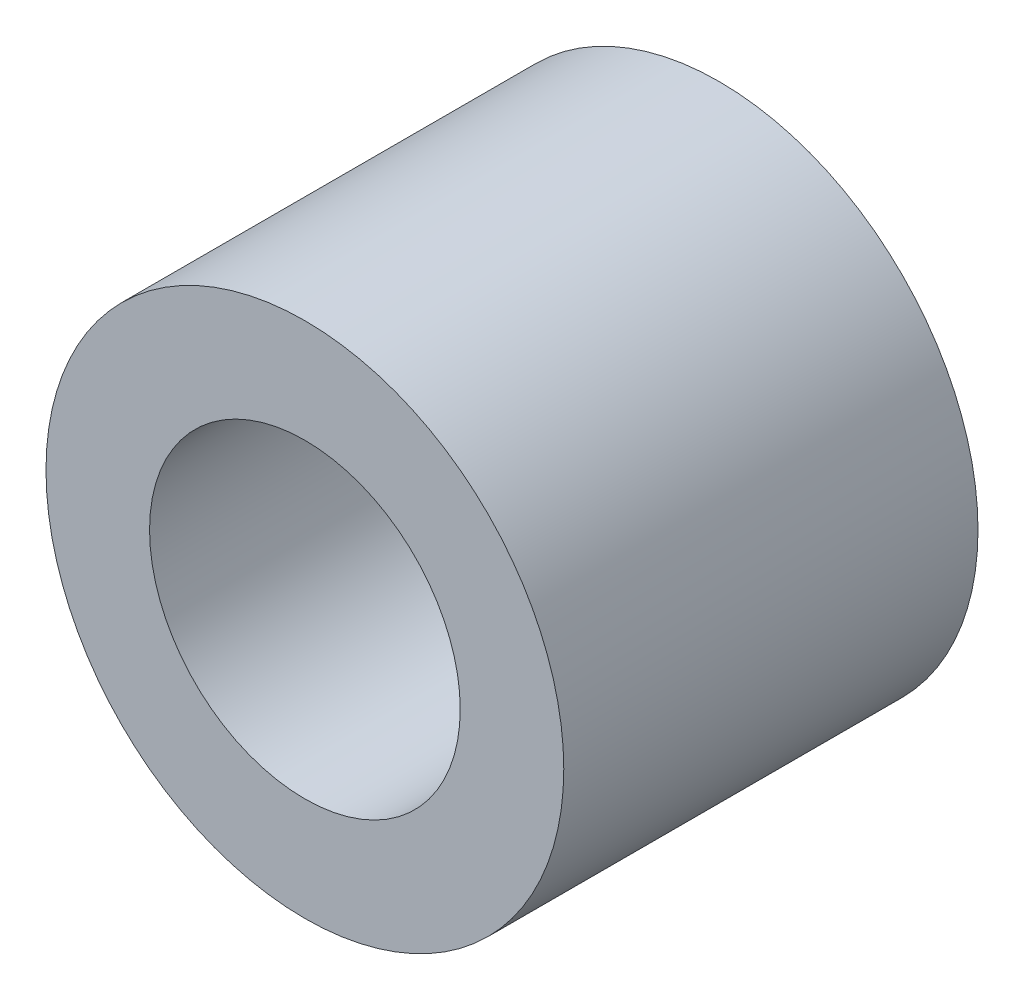
ISO-10303-21;
HEADER;
FILE_DESCRIPTION(('STEP AP214'),'2;1');
FILE_NAME('part.step','',(''),(''),'','','');
FILE_SCHEMA(('AUTOMOTIVE_DESIGN { 1 0 10303 214 1 1 1 1 }'));
ENDSEC;
DATA;
#1=APPLICATION_CONTEXT('core data for automotive mechanical design processes');
#2=APPLICATION_PROTOCOL_DEFINITION('international standard','automotive_design',2000,#1);
#3=PRODUCT_CONTEXT('',#1,'mechanical');
#4=PRODUCT('Part','Part','',(#3));
#5=PRODUCT_RELATED_PRODUCT_CATEGORY('part','',(#4));
#6=PRODUCT_DEFINITION_FORMATION('','',#4);
#7=PRODUCT_DEFINITION_CONTEXT('part definition',#1,'design');
#8=PRODUCT_DEFINITION('design','',#6,#7);
#9=PRODUCT_DEFINITION_SHAPE('','',#8);
#10=(LENGTH_UNIT() NAMED_UNIT(*) SI_UNIT(.MILLI.,.METRE.));
#11=(NAMED_UNIT(*) PLANE_ANGLE_UNIT() SI_UNIT($,.RADIAN.));
#12=(NAMED_UNIT(*) SI_UNIT($,.STERADIAN.) SOLID_ANGLE_UNIT());
#13=UNCERTAINTY_MEASURE_WITH_UNIT(LENGTH_MEASURE(1.E-05),#10,'distance_accuracy_value','');
#14=(GEOMETRIC_REPRESENTATION_CONTEXT(3) GLOBAL_UNCERTAINTY_ASSIGNED_CONTEXT((#13)) GLOBAL_UNIT_ASSIGNED_CONTEXT((#10,
#11,#12)) REPRESENTATION_CONTEXT('',''));
#15=CARTESIAN_POINT('',(0.,0.,0.));
#16=DIRECTION('',(0.,0.,1.));
#17=DIRECTION('',(1.,0.,0.));
#18=AXIS2_PLACEMENT_3D('',#15,#16,#17);
#19=CARTESIAN_POINT('',(0.,0.,3.175));
#20=DIRECTION('',(0.,0.,1.));
#21=DIRECTION('',(1.,0.,0.));
#22=AXIS2_PLACEMENT_3D('',#19,#20,#21);
#23=PLANE('',#22);
#24=CARTESIAN_POINT('',(0.,0.,3.175));
#25=DIRECTION('',(0.,0.,1.));
#26=DIRECTION('',(1.,0.,0.));
#27=AXIS2_PLACEMENT_3D('',#24,#25,#26);
#28=CIRCLE('',#27,3.96875);
#29=CARTESIAN_POINT('',(3.96875,0.,3.175));
#30=VERTEX_POINT('',#29);
#31=EDGE_CURVE('E10',#30,#30,#28,.T.);
#32=ORIENTED_EDGE('',*,*,#31,.T.);
#33=EDGE_LOOP('',(#32));
#34=FACE_BOUND('',#33,.T.);
#35=CARTESIAN_POINT('',(0.,0.,3.175));
#36=DIRECTION('',(0.,0.,1.));
#37=DIRECTION('',(1.,0.,0.));
#38=AXIS2_PLACEMENT_3D('',#35,#36,#37);
#39=CIRCLE('',#38,2.38125);
#40=CARTESIAN_POINT('',(2.38125,0.,3.175));
#41=VERTEX_POINT('',#40);
#42=EDGE_CURVE('E45',#41,#41,#39,.T.);
#43=ORIENTED_EDGE('',*,*,#42,.F.);
#44=EDGE_LOOP('',(#43));
#45=FACE_BOUND('',#44,.T.);
#46=ADVANCED_FACE('F34',(#34,#45),#23,.T.);
#47=CARTESIAN_POINT('',(0.,0.,-3.175));
#48=DIRECTION('',(0.,0.,1.));
#49=DIRECTION('',(1.,0.,0.));
#50=AXIS2_PLACEMENT_3D('',#47,#48,#49);
#51=PLANE('',#50);
#52=CARTESIAN_POINT('',(0.,0.,-3.175));
#53=DIRECTION('',(0.,0.,1.));
#54=DIRECTION('',(1.,0.,0.));
#55=AXIS2_PLACEMENT_3D('',#52,#53,#54);
#56=CIRCLE('',#55,3.96875);
#57=CARTESIAN_POINT('',(3.96875,0.,-3.175));
#58=VERTEX_POINT('',#57);
#59=EDGE_CURVE('E38',#58,#58,#56,.T.);
#60=ORIENTED_EDGE('',*,*,#59,.F.);
#61=EDGE_LOOP('',(#60));
#62=FACE_BOUND('',#61,.T.);
#63=CARTESIAN_POINT('',(0.,0.,-3.175));
#64=DIRECTION('',(0.,0.,1.));
#65=DIRECTION('',(1.,0.,0.));
#66=AXIS2_PLACEMENT_3D('',#63,#64,#65);
#67=CIRCLE('',#66,2.38125);
#68=CARTESIAN_POINT('',(2.38125,0.,-3.175));
#69=VERTEX_POINT('',#68);
#70=EDGE_CURVE('E47',#69,#69,#67,.T.);
#71=ORIENTED_EDGE('',*,*,#70,.T.);
#72=EDGE_LOOP('',(#71));
#73=FACE_BOUND('',#72,.T.);
#74=ADVANCED_FACE('F57',(#62,#73),#51,.F.);
#75=CARTESIAN_POINT('',(0.,0.,3.175));
#76=DIRECTION('',(0.,0.,-1.));
#77=DIRECTION('',(-1.,0.,0.));
#78=AXIS2_PLACEMENT_3D('',#75,#76,#77);
#79=CYLINDRICAL_SURFACE('',#78,3.96875);
#80=ORIENTED_EDGE('',*,*,#31,.F.);
#81=EDGE_LOOP('',(#80));
#82=FACE_BOUND('',#81,.T.);
#83=ORIENTED_EDGE('',*,*,#59,.T.);
#84=EDGE_LOOP('',(#83));
#85=FACE_BOUND('',#84,.T.);
#86=ADVANCED_FACE('F36',(#82,#85),#79,.T.);
#87=CARTESIAN_POINT('',(0.,0.,3.175));
#88=DIRECTION('',(0.,0.,-1.));
#89=DIRECTION('',(-1.,0.,0.));
#90=AXIS2_PLACEMENT_3D('',#87,#88,#89);
#91=CYLINDRICAL_SURFACE('',#90,2.38125);
#92=ORIENTED_EDGE('',*,*,#42,.T.);
#93=EDGE_LOOP('',(#92));
#94=FACE_BOUND('',#93,.T.);
#95=ORIENTED_EDGE('',*,*,#70,.F.);
#96=EDGE_LOOP('',(#95));
#97=FACE_BOUND('',#96,.T.);
#98=ADVANCED_FACE('F53',(#94,#97),#91,.F.);
#99=CLOSED_SHELL('',(#46,#74,#86,#98));
#100=MANIFOLD_SOLID_BREP('B2',#99);
#101=ADVANCED_BREP_SHAPE_REPRESENTATION('',(#18,#100),#14);
#102=SHAPE_DEFINITION_REPRESENTATION(#9,#101);
ENDSEC;
END-ISO-10303-21;
